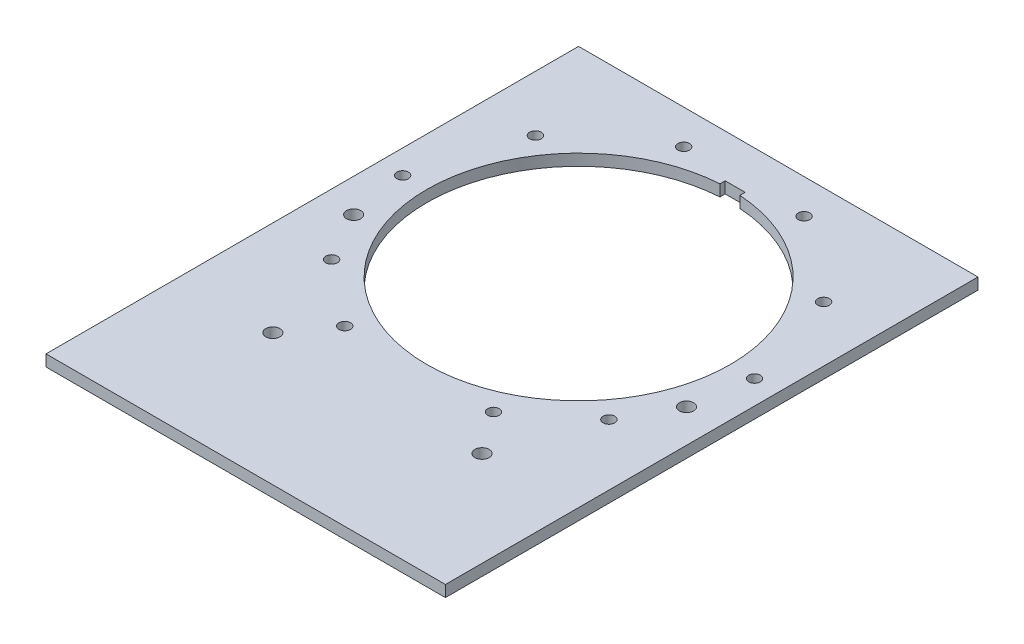
ISO-10303-21;
HEADER;
FILE_DESCRIPTION(('STEP AP214'),'2;1');
FILE_NAME('part.step','',(''),(''),'','','');
FILE_SCHEMA(('AUTOMOTIVE_DESIGN { 1 0 10303 214 1 1 1 1 }'));
ENDSEC;
DATA;
#1=APPLICATION_CONTEXT('core data for automotive mechanical design processes');
#2=APPLICATION_PROTOCOL_DEFINITION('international standard','automotive_design',2000,#1);
#3=PRODUCT_CONTEXT('',#1,'mechanical');
#4=PRODUCT('Part','Part','',(#3));
#5=PRODUCT_RELATED_PRODUCT_CATEGORY('part','',(#4));
#6=PRODUCT_DEFINITION_FORMATION('','',#4);
#7=PRODUCT_DEFINITION_CONTEXT('part definition',#1,'design');
#8=PRODUCT_DEFINITION('design','',#6,#7);
#9=PRODUCT_DEFINITION_SHAPE('','',#8);
#10=(LENGTH_UNIT() NAMED_UNIT(*) SI_UNIT(.MILLI.,.METRE.));
#11=(NAMED_UNIT(*) PLANE_ANGLE_UNIT() SI_UNIT($,.RADIAN.));
#12=(NAMED_UNIT(*) SI_UNIT($,.STERADIAN.) SOLID_ANGLE_UNIT());
#13=UNCERTAINTY_MEASURE_WITH_UNIT(LENGTH_MEASURE(1.E-05),#10,'distance_accuracy_value','');
#14=(GEOMETRIC_REPRESENTATION_CONTEXT(3) GLOBAL_UNCERTAINTY_ASSIGNED_CONTEXT((#13)) GLOBAL_UNIT_ASSIGNED_CONTEXT((#10,
#11,#12)) REPRESENTATION_CONTEXT('',''));
#15=CARTESIAN_POINT('',(0.,0.,0.));
#16=DIRECTION('',(0.,0.,1.));
#17=DIRECTION('',(1.,0.,0.));
#18=AXIS2_PLACEMENT_3D('',#15,#16,#17);
#19=CARTESIAN_POINT('',(0.,12.,0.));
#20=DIRECTION('',(0.,1.,0.));
#21=DIRECTION('',(0.,0.,1.));
#22=AXIS2_PLACEMENT_3D('',#19,#20,#21);
#23=PLANE('',#22);
#24=CARTESIAN_POINT('',(145.781989417244,12.,113.897372935246));
#25=DIRECTION('',(0.,1.,0.));
#26=DIRECTION('',(0.,0.,-1.));
#27=AXIS2_PLACEMENT_3D('',#24,#25,#26);
#28=CIRCLE('',#27,6.09999999999998);
#29=CARTESIAN_POINT('',(145.781989417244,12.,107.797372935246));
#30=VERTEX_POINT('',#29);
#31=EDGE_CURVE('E297',#30,#30,#28,.T.);
#32=ORIENTED_EDGE('',*,*,#31,.F.);
#33=EDGE_LOOP('',(#32));
#34=FACE_BOUND('',#33,.T.);
#35=CARTESIAN_POINT('',(-145.781989417244,12.,113.897372935246));
#36=DIRECTION('',(0.,1.,0.));
#37=DIRECTION('',(0.,0.,1.));
#38=AXIS2_PLACEMENT_3D('',#35,#36,#37);
#39=CIRCLE('',#38,6.09999999999998);
#40=CARTESIAN_POINT('',(-145.781989417244,12.,119.997372935246));
#41=VERTEX_POINT('',#40);
#42=EDGE_CURVE('E309',#41,#41,#39,.T.);
#43=ORIENTED_EDGE('',*,*,#42,.F.);
#44=EDGE_LOOP('',(#43));
#45=FACE_BOUND('',#44,.T.);
#46=CARTESIAN_POINT('',(-151.543128193463,12.,-106.111640724945));
#47=DIRECTION('',(0.,1.,0.));
#48=DIRECTION('',(0.,0.,1.));
#49=AXIS2_PLACEMENT_3D('',#46,#47,#48);
#50=CIRCLE('',#49,6.09999999999998);
#51=CARTESIAN_POINT('',(-151.543128193463,12.,-100.011640724945));
#52=VERTEX_POINT('',#51);
#53=EDGE_CURVE('E321',#52,#52,#50,.T.);
#54=ORIENTED_EDGE('',*,*,#53,.F.);
#55=EDGE_LOOP('',(#54));
#56=FACE_BOUND('',#55,.T.);
#57=CARTESIAN_POINT('',(175.,12.,61.5));
#58=DIRECTION('',(0.,1.,0.));
#59=DIRECTION('',(0.,0.,1.));
#60=AXIS2_PLACEMENT_3D('',#57,#58,#59);
#61=CIRCLE('',#60,7.50000000000001);
#62=CARTESIAN_POINT('',(175.,12.,69.));
#63=VERTEX_POINT('',#62);
#64=EDGE_CURVE('E333',#63,#63,#61,.T.);
#65=ORIENTED_EDGE('',*,*,#64,.F.);
#66=EDGE_LOOP('',(#65));
#67=FACE_BOUND('',#66,.T.);
#68=CARTESIAN_POINT('',(63.2737265152475,12.,-173.843134845393));
#69=DIRECTION('',(0.,1.,0.));
#70=DIRECTION('',(0.,0.,-1.));
#71=AXIS2_PLACEMENT_3D('',#68,#69,#70);
#72=CIRCLE('',#71,6.09999999999999);
#73=CARTESIAN_POINT('',(63.2737265152475,12.,-179.943134845393));
#74=VERTEX_POINT('',#73);
#75=EDGE_CURVE('E345',#74,#74,#72,.T.);
#76=ORIENTED_EDGE('',*,*,#75,.F.);
#77=EDGE_LOOP('',(#76));
#78=FACE_BOUND('',#77,.T.);
#79=CARTESIAN_POINT('',(-175.,12.,61.5));
#80=DIRECTION('',(0.,1.,0.));
#81=DIRECTION('',(0.,0.,1.));
#82=AXIS2_PLACEMENT_3D('',#79,#80,#81);
#83=CIRCLE('',#82,7.50000000000001);
#84=CARTESIAN_POINT('',(-175.,12.,69.));
#85=VERTEX_POINT('',#84);
#86=EDGE_CURVE('E357',#85,#85,#83,.T.);
#87=ORIENTED_EDGE('',*,*,#86,.F.);
#88=EDGE_LOOP('',(#87));
#89=FACE_BOUND('',#88,.T.);
#90=DIRECTION('',(0.,0.,1.));
#91=VECTOR('',#90,1.);
#92=CARTESIAN_POINT('',(-10.5,12.,-164.654013458662));
#93=LINE('',#92,#91);
#94=CARTESIAN_POINT('',(-10.5,12.,-164.654013458662));
#95=VERTEX_POINT('',#94);
#96=CARTESIAN_POINT('',(-10.4999999999999,12.,-159.154013458662));
#97=VERTEX_POINT('',#96);
#98=EDGE_CURVE('E107',#95,#97,#93,.T.);
#99=ORIENTED_EDGE('',*,*,#98,.F.);
#100=DIRECTION('',(-1.,0.,0.));
#101=VECTOR('',#100,1.);
#102=CARTESIAN_POINT('',(10.5,12.,-164.654013458662));
#103=LINE('',#102,#101);
#104=CARTESIAN_POINT('',(10.5,12.,-164.654013458662));
#105=VERTEX_POINT('',#104);
#106=EDGE_CURVE('E99',#105,#95,#103,.T.);
#107=ORIENTED_EDGE('',*,*,#106,.F.);
#108=DIRECTION('',(0.,0.,-1.));
#109=VECTOR('',#108,1.);
#110=CARTESIAN_POINT('',(10.5,12.,-164.654013458662));
#111=LINE('',#110,#109);
#112=CARTESIAN_POINT('',(10.5,12.,-159.154013458662));
#113=VERTEX_POINT('',#112);
#114=EDGE_CURVE('E122',#113,#105,#111,.T.);
#115=ORIENTED_EDGE('',*,*,#114,.F.);
#116=CARTESIAN_POINT('',(0.,12.,0.));
#117=DIRECTION('',(0.,1.,0.));
#118=DIRECTION('',(0.,0.,1.));
#119=AXIS2_PLACEMENT_3D('',#116,#117,#118);
#120=CIRCLE('',#119,159.5);
#121=EDGE_CURVE('E120',#97,#113,#120,.T.);
#122=ORIENTED_EDGE('',*,*,#121,.F.);
#123=EDGE_LOOP('',(#99,#107,#115,#122));
#124=FACE_BOUND('',#123,.T.);
#125=CARTESIAN_POINT('',(-63.2737265152472,12.,-173.843134845394));
#126=DIRECTION('',(0.,1.,0.));
#127=DIRECTION('',(0.,0.,1.));
#128=AXIS2_PLACEMENT_3D('',#125,#126,#127);
#129=CIRCLE('',#128,6.1);
#130=CARTESIAN_POINT('',(-63.2737265152472,12.,-167.743134845394));
#131=VERTEX_POINT('',#130);
#132=EDGE_CURVE('E138',#131,#131,#129,.T.);
#133=ORIENTED_EDGE('',*,*,#132,.F.);
#134=EDGE_LOOP('',(#133));
#135=FACE_BOUND('',#134,.T.);
#136=DIRECTION('',(0.,0.,1.));
#137=VECTOR('',#136,1.);
#138=CARTESIAN_POINT('',(-210.,12.,-210.));
#139=LINE('',#138,#137);
#140=CARTESIAN_POINT('',(-210.,12.,-210.));
#141=VERTEX_POINT('',#140);
#142=CARTESIAN_POINT('',(-210.,12.,350.));
#143=VERTEX_POINT('',#142);
#144=EDGE_CURVE('E144',#141,#143,#139,.T.);
#145=ORIENTED_EDGE('',*,*,#144,.T.);
#146=DIRECTION('',(1.,0.,0.));
#147=VECTOR('',#146,1.);
#148=CARTESIAN_POINT('',(-210.,12.,350.));
#149=LINE('',#148,#147);
#150=CARTESIAN_POINT('',(210.,12.,350.));
#151=VERTEX_POINT('',#150);
#152=EDGE_CURVE('E147',#143,#151,#149,.T.);
#153=ORIENTED_EDGE('',*,*,#152,.T.);
#154=DIRECTION('',(0.,0.,-1.));
#155=VECTOR('',#154,1.);
#156=CARTESIAN_POINT('',(210.,12.,-210.));
#157=LINE('',#156,#155);
#158=CARTESIAN_POINT('',(210.,12.,-210.));
#159=VERTEX_POINT('',#158);
#160=EDGE_CURVE('E150',#151,#159,#157,.T.);
#161=ORIENTED_EDGE('',*,*,#160,.T.);
#162=DIRECTION('',(-1.,0.,0.));
#163=VECTOR('',#162,1.);
#164=CARTESIAN_POINT('',(-210.,12.,-210.));
#165=LINE('',#164,#163);
#166=EDGE_CURVE('E152',#159,#141,#165,.T.);
#167=ORIENTED_EDGE('',*,*,#166,.T.);
#168=EDGE_LOOP('',(#145,#153,#161,#167));
#169=FACE_BOUND('',#168,.T.);
#170=CARTESIAN_POINT('',(151.543128193463,12.,-106.111640724944));
#171=DIRECTION('',(0.,1.,0.));
#172=DIRECTION('',(0.,0.,-1.));
#173=AXIS2_PLACEMENT_3D('',#170,#171,#172);
#174=CIRCLE('',#173,6.09999999999998);
#175=CARTESIAN_POINT('',(151.543128193463,12.,-112.211640724944));
#176=VERTEX_POINT('',#175);
#177=EDGE_CURVE('E128',#176,#176,#174,.T.);
#178=ORIENTED_EDGE('',*,*,#177,.F.);
#179=EDGE_LOOP('',(#178));
#180=FACE_BOUND('',#179,.T.);
#181=CARTESIAN_POINT('',(110.003214300474,12.,211.5));
#182=DIRECTION('',(0.,1.,0.));
#183=DIRECTION('',(0.,0.,1.));
#184=AXIS2_PLACEMENT_3D('',#181,#182,#183);
#185=CIRCLE('',#184,7.50000000000001);
#186=CARTESIAN_POINT('',(110.003214300474,12.,219.));
#187=VERTEX_POINT('',#186);
#188=EDGE_CURVE('E351',#187,#187,#185,.T.);
#189=ORIENTED_EDGE('',*,*,#188,.F.);
#190=EDGE_LOOP('',(#189));
#191=FACE_BOUND('',#190,.T.);
#192=CARTESIAN_POINT('',(-109.996785699526,12.,211.5));
#193=DIRECTION('',(0.,1.,0.));
#194=DIRECTION('',(0.,0.,1.));
#195=AXIS2_PLACEMENT_3D('',#192,#193,#194);
#196=CIRCLE('',#195,7.50000000000001);
#197=CARTESIAN_POINT('',(-109.996785699526,12.,219.));
#198=VERTEX_POINT('',#197);
#199=EDGE_CURVE('E339',#198,#198,#196,.T.);
#200=ORIENTED_EDGE('',*,*,#199,.F.);
#201=EDGE_LOOP('',(#200));
#202=FACE_BOUND('',#201,.T.);
#203=CARTESIAN_POINT('',(185.,12.,0.));
#204=DIRECTION('',(0.,1.,0.));
#205=DIRECTION('',(0.,0.,1.));
#206=AXIS2_PLACEMENT_3D('',#203,#204,#205);
#207=CIRCLE('',#206,6.09999999999998);
#208=CARTESIAN_POINT('',(185.,12.,6.09999999999998));
#209=VERTEX_POINT('',#208);
#210=EDGE_CURVE('E327',#209,#209,#207,.T.);
#211=ORIENTED_EDGE('',*,*,#210,.F.);
#212=EDGE_LOOP('',(#211));
#213=FACE_BOUND('',#212,.T.);
#214=CARTESIAN_POINT('',(-185.,12.,1.11022302462516E-13));
#215=DIRECTION('',(0.,1.,0.));
#216=DIRECTION('',(0.,0.,-1.));
#217=AXIS2_PLACEMENT_3D('',#214,#215,#216);
#218=CIRCLE('',#217,6.09999999999998);
#219=CARTESIAN_POINT('',(-185.,12.,-6.09999999999987));
#220=VERTEX_POINT('',#219);
#221=EDGE_CURVE('E315',#220,#220,#218,.T.);
#222=ORIENTED_EDGE('',*,*,#221,.F.);
#223=EDGE_LOOP('',(#222));
#224=FACE_BOUND('',#223,.T.);
#225=CARTESIAN_POINT('',(-78.1843784220302,12.,167.66694060178));
#226=DIRECTION('',(0.,1.,0.));
#227=DIRECTION('',(0.,0.,1.));
#228=AXIS2_PLACEMENT_3D('',#225,#226,#227);
#229=CIRCLE('',#228,6.09999999999999);
#230=CARTESIAN_POINT('',(-78.1843784220302,12.,173.76694060178));
#231=VERTEX_POINT('',#230);
#232=EDGE_CURVE('E303',#231,#231,#229,.T.);
#233=ORIENTED_EDGE('',*,*,#232,.F.);
#234=EDGE_LOOP('',(#233));
#235=FACE_BOUND('',#234,.T.);
#236=CARTESIAN_POINT('',(78.1843784220303,12.,167.66694060178));
#237=DIRECTION('',(0.,1.,0.));
#238=DIRECTION('',(0.,0.,-1.));
#239=AXIS2_PLACEMENT_3D('',#236,#237,#238);
#240=CIRCLE('',#239,6.09999999999999);
#241=CARTESIAN_POINT('',(78.1843784220303,12.,161.56694060178));
#242=VERTEX_POINT('',#241);
#243=EDGE_CURVE('E288',#242,#242,#240,.T.);
#244=ORIENTED_EDGE('',*,*,#243,.F.);
#245=EDGE_LOOP('',(#244));
#246=FACE_BOUND('',#245,.T.);
#247=ADVANCED_FACE('F34',(#34,#45,#56,#67,#78,#89,#124,#135,#169,#180,#191,#202,#213,#224,#235,
#246),#23,.T.);
#248=CARTESIAN_POINT('',(0.,0.,0.));
#249=DIRECTION('',(0.,1.,0.));
#250=DIRECTION('',(0.,0.,1.));
#251=AXIS2_PLACEMENT_3D('',#248,#249,#250);
#252=PLANE('',#251);
#253=CARTESIAN_POINT('',(-63.2737265152472,0.,-173.843134845394));
#254=DIRECTION('',(0.,1.,0.));
#255=DIRECTION('',(0.,0.,1.));
#256=AXIS2_PLACEMENT_3D('',#253,#254,#255);
#257=CIRCLE('',#256,6.1);
#258=CARTESIAN_POINT('',(-63.2737265152472,0.,-167.743134845394));
#259=VERTEX_POINT('',#258);
#260=EDGE_CURVE('E115',#259,#259,#257,.T.);
#261=ORIENTED_EDGE('',*,*,#260,.T.);
#262=EDGE_LOOP('',(#261));
#263=FACE_BOUND('',#262,.T.);
#264=DIRECTION('',(0.,0.,1.));
#265=VECTOR('',#264,1.);
#266=CARTESIAN_POINT('',(-210.,0.,-210.));
#267=LINE('',#266,#265);
#268=CARTESIAN_POINT('',(-210.,0.,-210.));
#269=VERTEX_POINT('',#268);
#270=CARTESIAN_POINT('',(-210.,0.,350.));
#271=VERTEX_POINT('',#270);
#272=EDGE_CURVE('E141',#269,#271,#267,.T.);
#273=ORIENTED_EDGE('',*,*,#272,.F.);
#274=DIRECTION('',(-1.,0.,0.));
#275=VECTOR('',#274,1.);
#276=CARTESIAN_POINT('',(-210.,0.,-210.));
#277=LINE('',#276,#275);
#278=CARTESIAN_POINT('',(210.,0.,-210.));
#279=VERTEX_POINT('',#278);
#280=EDGE_CURVE('E148',#279,#269,#277,.T.);
#281=ORIENTED_EDGE('',*,*,#280,.F.);
#282=DIRECTION('',(0.,0.,-1.));
#283=VECTOR('',#282,1.);
#284=CARTESIAN_POINT('',(210.,0.,-210.));
#285=LINE('',#284,#283);
#286=CARTESIAN_POINT('',(210.,0.,350.));
#287=VERTEX_POINT('',#286);
#288=EDGE_CURVE('E159',#287,#279,#285,.T.);
#289=ORIENTED_EDGE('',*,*,#288,.F.);
#290=DIRECTION('',(1.,0.,0.));
#291=VECTOR('',#290,1.);
#292=CARTESIAN_POINT('',(-210.,0.,350.));
#293=LINE('',#292,#291);
#294=EDGE_CURVE('E157',#271,#287,#293,.T.);
#295=ORIENTED_EDGE('',*,*,#294,.F.);
#296=EDGE_LOOP('',(#273,#281,#289,#295));
#297=FACE_BOUND('',#296,.T.);
#298=DIRECTION('',(-1.,0.,0.));
#299=VECTOR('',#298,1.);
#300=CARTESIAN_POINT('',(10.5,0.,-164.654013458662));
#301=LINE('',#300,#299);
#302=CARTESIAN_POINT('',(10.5,0.,-164.654013458662));
#303=VERTEX_POINT('',#302);
#304=CARTESIAN_POINT('',(-10.5,0.,-164.654013458662));
#305=VERTEX_POINT('',#304);
#306=EDGE_CURVE('E57',#303,#305,#301,.T.);
#307=ORIENTED_EDGE('',*,*,#306,.T.);
#308=DIRECTION('',(0.,0.,1.));
#309=VECTOR('',#308,1.);
#310=CARTESIAN_POINT('',(-10.5,0.,-164.654013458662));
#311=LINE('',#310,#309);
#312=CARTESIAN_POINT('',(-10.4999999999999,0.,-159.154013458662));
#313=VERTEX_POINT('',#312);
#314=EDGE_CURVE('E114',#305,#313,#311,.T.);
#315=ORIENTED_EDGE('',*,*,#314,.T.);
#316=CARTESIAN_POINT('',(0.,0.,0.));
#317=DIRECTION('',(0.,1.,0.));
#318=DIRECTION('',(0.,0.,1.));
#319=AXIS2_PLACEMENT_3D('',#316,#317,#318);
#320=CIRCLE('',#319,159.5);
#321=CARTESIAN_POINT('',(10.5,0.,-159.154013458662));
#322=VERTEX_POINT('',#321);
#323=EDGE_CURVE('E130',#313,#322,#320,.T.);
#324=ORIENTED_EDGE('',*,*,#323,.T.);
#325=DIRECTION('',(0.,0.,-1.));
#326=VECTOR('',#325,1.);
#327=CARTESIAN_POINT('',(10.5,0.,-164.654013458662));
#328=LINE('',#327,#326);
#329=EDGE_CURVE('E108',#322,#303,#328,.T.);
#330=ORIENTED_EDGE('',*,*,#329,.T.);
#331=EDGE_LOOP('',(#307,#315,#324,#330));
#332=FACE_BOUND('',#331,.T.);
#333=CARTESIAN_POINT('',(151.543128193463,0.,-106.111640724944));
#334=DIRECTION('',(0.,1.,0.));
#335=DIRECTION('',(0.,0.,-1.));
#336=AXIS2_PLACEMENT_3D('',#333,#334,#335);
#337=CIRCLE('',#336,6.09999999999998);
#338=CARTESIAN_POINT('',(151.543128193463,0.,-112.211640724944));
#339=VERTEX_POINT('',#338);
#340=EDGE_CURVE('E360',#339,#339,#337,.T.);
#341=ORIENTED_EDGE('',*,*,#340,.T.);
#342=EDGE_LOOP('',(#341));
#343=FACE_BOUND('',#342,.T.);
#344=CARTESIAN_POINT('',(-175.,0.,61.5));
#345=DIRECTION('',(0.,1.,0.));
#346=DIRECTION('',(0.,0.,1.));
#347=AXIS2_PLACEMENT_3D('',#344,#345,#346);
#348=CIRCLE('',#347,7.50000000000001);
#349=CARTESIAN_POINT('',(-175.,0.,69.));
#350=VERTEX_POINT('',#349);
#351=EDGE_CURVE('E354',#350,#350,#348,.T.);
#352=ORIENTED_EDGE('',*,*,#351,.T.);
#353=EDGE_LOOP('',(#352));
#354=FACE_BOUND('',#353,.T.);
#355=CARTESIAN_POINT('',(110.003214300474,0.,211.5));
#356=DIRECTION('',(0.,1.,0.));
#357=DIRECTION('',(0.,0.,1.));
#358=AXIS2_PLACEMENT_3D('',#355,#356,#357);
#359=CIRCLE('',#358,7.50000000000001);
#360=CARTESIAN_POINT('',(110.003214300474,0.,219.));
#361=VERTEX_POINT('',#360);
#362=EDGE_CURVE('E348',#361,#361,#359,.T.);
#363=ORIENTED_EDGE('',*,*,#362,.T.);
#364=EDGE_LOOP('',(#363));
#365=FACE_BOUND('',#364,.T.);
#366=CARTESIAN_POINT('',(63.2737265152475,0.,-173.843134845393));
#367=DIRECTION('',(0.,1.,0.));
#368=DIRECTION('',(0.,0.,-1.));
#369=AXIS2_PLACEMENT_3D('',#366,#367,#368);
#370=CIRCLE('',#369,6.09999999999999);
#371=CARTESIAN_POINT('',(63.2737265152475,0.,-179.943134845393));
#372=VERTEX_POINT('',#371);
#373=EDGE_CURVE('E342',#372,#372,#370,.T.);
#374=ORIENTED_EDGE('',*,*,#373,.T.);
#375=EDGE_LOOP('',(#374));
#376=FACE_BOUND('',#375,.T.);
#377=CARTESIAN_POINT('',(-109.996785699526,0.,211.5));
#378=DIRECTION('',(0.,1.,0.));
#379=DIRECTION('',(0.,0.,1.));
#380=AXIS2_PLACEMENT_3D('',#377,#378,#379);
#381=CIRCLE('',#380,7.50000000000001);
#382=CARTESIAN_POINT('',(-109.996785699526,0.,219.));
#383=VERTEX_POINT('',#382);
#384=EDGE_CURVE('E336',#383,#383,#381,.T.);
#385=ORIENTED_EDGE('',*,*,#384,.T.);
#386=EDGE_LOOP('',(#385));
#387=FACE_BOUND('',#386,.T.);
#388=CARTESIAN_POINT('',(175.,0.,61.5));
#389=DIRECTION('',(0.,1.,0.));
#390=DIRECTION('',(0.,0.,1.));
#391=AXIS2_PLACEMENT_3D('',#388,#389,#390);
#392=CIRCLE('',#391,7.50000000000001);
#393=CARTESIAN_POINT('',(175.,0.,69.));
#394=VERTEX_POINT('',#393);
#395=EDGE_CURVE('E330',#394,#394,#392,.T.);
#396=ORIENTED_EDGE('',*,*,#395,.T.);
#397=EDGE_LOOP('',(#396));
#398=FACE_BOUND('',#397,.T.);
#399=CARTESIAN_POINT('',(185.,0.,0.));
#400=DIRECTION('',(0.,1.,0.));
#401=DIRECTION('',(0.,0.,1.));
#402=AXIS2_PLACEMENT_3D('',#399,#400,#401);
#403=CIRCLE('',#402,6.09999999999998);
#404=CARTESIAN_POINT('',(185.,0.,6.09999999999998));
#405=VERTEX_POINT('',#404);
#406=EDGE_CURVE('E324',#405,#405,#403,.T.);
#407=ORIENTED_EDGE('',*,*,#406,.T.);
#408=EDGE_LOOP('',(#407));
#409=FACE_BOUND('',#408,.T.);
#410=CARTESIAN_POINT('',(-151.543128193463,0.,-106.111640724945));
#411=DIRECTION('',(0.,1.,0.));
#412=DIRECTION('',(0.,0.,1.));
#413=AXIS2_PLACEMENT_3D('',#410,#411,#412);
#414=CIRCLE('',#413,6.09999999999998);
#415=CARTESIAN_POINT('',(-151.543128193463,0.,-100.011640724945));
#416=VERTEX_POINT('',#415);
#417=EDGE_CURVE('E318',#416,#416,#414,.T.);
#418=ORIENTED_EDGE('',*,*,#417,.T.);
#419=EDGE_LOOP('',(#418));
#420=FACE_BOUND('',#419,.T.);
#421=CARTESIAN_POINT('',(-185.,0.,1.11022302462516E-13));
#422=DIRECTION('',(0.,1.,0.));
#423=DIRECTION('',(0.,0.,-1.));
#424=AXIS2_PLACEMENT_3D('',#421,#422,#423);
#425=CIRCLE('',#424,6.09999999999998);
#426=CARTESIAN_POINT('',(-185.,0.,-6.09999999999987));
#427=VERTEX_POINT('',#426);
#428=EDGE_CURVE('E312',#427,#427,#425,.T.);
#429=ORIENTED_EDGE('',*,*,#428,.T.);
#430=EDGE_LOOP('',(#429));
#431=FACE_BOUND('',#430,.T.);
#432=CARTESIAN_POINT('',(-145.781989417244,0.,113.897372935246));
#433=DIRECTION('',(0.,1.,0.));
#434=DIRECTION('',(0.,0.,1.));
#435=AXIS2_PLACEMENT_3D('',#432,#433,#434);
#436=CIRCLE('',#435,6.09999999999998);
#437=CARTESIAN_POINT('',(-145.781989417244,0.,119.997372935246));
#438=VERTEX_POINT('',#437);
#439=EDGE_CURVE('E306',#438,#438,#436,.T.);
#440=ORIENTED_EDGE('',*,*,#439,.T.);
#441=EDGE_LOOP('',(#440));
#442=FACE_BOUND('',#441,.T.);
#443=CARTESIAN_POINT('',(-78.1843784220302,0.,167.66694060178));
#444=DIRECTION('',(0.,1.,0.));
#445=DIRECTION('',(0.,0.,1.));
#446=AXIS2_PLACEMENT_3D('',#443,#444,#445);
#447=CIRCLE('',#446,6.09999999999999);
#448=CARTESIAN_POINT('',(-78.1843784220302,0.,173.76694060178));
#449=VERTEX_POINT('',#448);
#450=EDGE_CURVE('E300',#449,#449,#447,.T.);
#451=ORIENTED_EDGE('',*,*,#450,.T.);
#452=EDGE_LOOP('',(#451));
#453=FACE_BOUND('',#452,.T.);
#454=CARTESIAN_POINT('',(145.781989417244,0.,113.897372935246));
#455=DIRECTION('',(0.,1.,0.));
#456=DIRECTION('',(0.,0.,-1.));
#457=AXIS2_PLACEMENT_3D('',#454,#455,#456);
#458=CIRCLE('',#457,6.09999999999998);
#459=CARTESIAN_POINT('',(145.781989417244,0.,107.797372935246));
#460=VERTEX_POINT('',#459);
#461=EDGE_CURVE('E294',#460,#460,#458,.T.);
#462=ORIENTED_EDGE('',*,*,#461,.T.);
#463=EDGE_LOOP('',(#462));
#464=FACE_BOUND('',#463,.T.);
#465=CARTESIAN_POINT('',(78.1843784220303,0.,167.66694060178));
#466=DIRECTION('',(0.,1.,0.));
#467=DIRECTION('',(0.,0.,-1.));
#468=AXIS2_PLACEMENT_3D('',#465,#466,#467);
#469=CIRCLE('',#468,6.09999999999999);
#470=CARTESIAN_POINT('',(78.1843784220303,0.,161.56694060178));
#471=VERTEX_POINT('',#470);
#472=EDGE_CURVE('E291',#471,#471,#469,.T.);
#473=ORIENTED_EDGE('',*,*,#472,.T.);
#474=EDGE_LOOP('',(#473));
#475=FACE_BOUND('',#474,.T.);
#476=ADVANCED_FACE('F177',(#263,#297,#332,#343,#354,#365,#376,#387,#398,#409,#420,#431,#442,
#453,#464,#475),#252,.F.);
#477=CARTESIAN_POINT('',(-210.,12.,-210.));
#478=DIRECTION('',(1.,0.,0.));
#479=DIRECTION('',(0.,0.,-1.));
#480=AXIS2_PLACEMENT_3D('',#477,#478,#479);
#481=PLANE('',#480);
#482=ORIENTED_EDGE('',*,*,#272,.T.);
#483=DIRECTION('',(0.,-1.,0.));
#484=VECTOR('',#483,1.);
#485=CARTESIAN_POINT('',(-210.,12.,350.));
#486=LINE('',#485,#484);
#487=EDGE_CURVE('E11',#143,#271,#486,.T.);
#488=ORIENTED_EDGE('',*,*,#487,.F.);
#489=ORIENTED_EDGE('',*,*,#144,.F.);
#490=DIRECTION('',(0.,-1.,0.));
#491=VECTOR('',#490,1.);
#492=CARTESIAN_POINT('',(-210.,12.,-210.));
#493=LINE('',#492,#491);
#494=EDGE_CURVE('E154',#141,#269,#493,.T.);
#495=ORIENTED_EDGE('',*,*,#494,.T.);
#496=EDGE_LOOP('',(#482,#488,#489,#495));
#497=FACE_BOUND('',#496,.T.);
#498=ADVANCED_FACE('F36',(#497),#481,.F.);
#499=CARTESIAN_POINT('',(-210.,12.,350.));
#500=DIRECTION('',(0.,0.,-1.));
#501=DIRECTION('',(-1.,0.,0.));
#502=AXIS2_PLACEMENT_3D('',#499,#500,#501);
#503=PLANE('',#502);
#504=ORIENTED_EDGE('',*,*,#294,.T.);
#505=DIRECTION('',(0.,-1.,0.));
#506=VECTOR('',#505,1.);
#507=CARTESIAN_POINT('',(210.,12.,350.));
#508=LINE('',#507,#506);
#509=EDGE_CURVE('E42',#151,#287,#508,.T.);
#510=ORIENTED_EDGE('',*,*,#509,.F.);
#511=ORIENTED_EDGE('',*,*,#152,.F.);
#512=ORIENTED_EDGE('',*,*,#487,.T.);
#513=EDGE_LOOP('',(#504,#510,#511,#512));
#514=FACE_BOUND('',#513,.T.);
#515=ADVANCED_FACE('F188',(#514),#503,.F.);
#516=CARTESIAN_POINT('',(210.,12.,-210.));
#517=DIRECTION('',(-1.,0.,0.));
#518=DIRECTION('',(0.,0.,1.));
#519=AXIS2_PLACEMENT_3D('',#516,#517,#518);
#520=PLANE('',#519);
#521=ORIENTED_EDGE('',*,*,#288,.T.);
#522=DIRECTION('',(0.,-1.,0.));
#523=VECTOR('',#522,1.);
#524=CARTESIAN_POINT('',(210.,12.,-210.));
#525=LINE('',#524,#523);
#526=EDGE_CURVE('E164',#159,#279,#525,.T.);
#527=ORIENTED_EDGE('',*,*,#526,.F.);
#528=ORIENTED_EDGE('',*,*,#160,.F.);
#529=ORIENTED_EDGE('',*,*,#509,.T.);
#530=EDGE_LOOP('',(#521,#527,#528,#529));
#531=FACE_BOUND('',#530,.T.);
#532=ADVANCED_FACE('F171',(#531),#520,.F.);
#533=CARTESIAN_POINT('',(-210.,12.,-210.));
#534=DIRECTION('',(0.,0.,1.));
#535=DIRECTION('',(1.,0.,0.));
#536=AXIS2_PLACEMENT_3D('',#533,#534,#535);
#537=PLANE('',#536);
#538=ORIENTED_EDGE('',*,*,#280,.T.);
#539=ORIENTED_EDGE('',*,*,#494,.F.);
#540=ORIENTED_EDGE('',*,*,#166,.F.);
#541=ORIENTED_EDGE('',*,*,#526,.T.);
#542=EDGE_LOOP('',(#538,#539,#540,#541));
#543=FACE_BOUND('',#542,.T.);
#544=ADVANCED_FACE('F181',(#543),#537,.F.);
#545=CARTESIAN_POINT('',(-63.2737265152472,12.,-173.843134845394));
#546=DIRECTION('',(0.,-1.,0.));
#547=DIRECTION('',(0.,0.,-1.));
#548=AXIS2_PLACEMENT_3D('',#545,#546,#547);
#549=CYLINDRICAL_SURFACE('',#548,6.1);
#550=ORIENTED_EDGE('',*,*,#132,.T.);
#551=EDGE_LOOP('',(#550));
#552=FACE_BOUND('',#551,.T.);
#553=ORIENTED_EDGE('',*,*,#260,.F.);
#554=EDGE_LOOP('',(#553));
#555=FACE_BOUND('',#554,.T.);
#556=ADVANCED_FACE('F206',(#552,#555),#549,.F.);
#557=CARTESIAN_POINT('',(10.5,12.,-164.654013458662));
#558=DIRECTION('',(0.,0.,1.));
#559=DIRECTION('',(1.,0.,0.));
#560=AXIS2_PLACEMENT_3D('',#557,#558,#559);
#561=PLANE('',#560);
#562=ORIENTED_EDGE('',*,*,#306,.F.);
#563=DIRECTION('',(0.,-1.,0.));
#564=VECTOR('',#563,1.);
#565=CARTESIAN_POINT('',(10.5,12.,-164.654013458662));
#566=LINE('',#565,#564);
#567=EDGE_CURVE('E103',#105,#303,#566,.T.);
#568=ORIENTED_EDGE('',*,*,#567,.F.);
#569=ORIENTED_EDGE('',*,*,#106,.T.);
#570=DIRECTION('',(0.,-1.,0.));
#571=VECTOR('',#570,1.);
#572=CARTESIAN_POINT('',(-10.5,12.,-164.654013458662));
#573=LINE('',#572,#571);
#574=EDGE_CURVE('E102',#95,#305,#573,.T.);
#575=ORIENTED_EDGE('',*,*,#574,.T.);
#576=EDGE_LOOP('',(#562,#568,#569,#575));
#577=FACE_BOUND('',#576,.T.);
#578=ADVANCED_FACE('F101',(#577),#561,.T.);
#579=CARTESIAN_POINT('',(-10.5,12.,-164.654013458662));
#580=DIRECTION('',(1.,0.,0.));
#581=DIRECTION('',(0.,0.,-1.));
#582=AXIS2_PLACEMENT_3D('',#579,#580,#581);
#583=PLANE('',#582);
#584=ORIENTED_EDGE('',*,*,#314,.F.);
#585=ORIENTED_EDGE('',*,*,#574,.F.);
#586=ORIENTED_EDGE('',*,*,#98,.T.);
#587=DIRECTION('',(0.,-1.,0.));
#588=VECTOR('',#587,1.);
#589=CARTESIAN_POINT('',(-10.4999999999999,12.,-159.154013458662));
#590=LINE('',#589,#588);
#591=EDGE_CURVE('E116',#97,#313,#590,.T.);
#592=ORIENTED_EDGE('',*,*,#591,.T.);
#593=EDGE_LOOP('',(#584,#585,#586,#592));
#594=FACE_BOUND('',#593,.T.);
#595=ADVANCED_FACE('F111',(#594),#583,.T.);
#596=CARTESIAN_POINT('',(0.,12.,0.));
#597=DIRECTION('',(0.,-1.,0.));
#598=DIRECTION('',(0.,0.,-1.));
#599=AXIS2_PLACEMENT_3D('',#596,#597,#598);
#600=CYLINDRICAL_SURFACE('',#599,159.5);
#601=ORIENTED_EDGE('',*,*,#323,.F.);
#602=ORIENTED_EDGE('',*,*,#591,.F.);
#603=ORIENTED_EDGE('',*,*,#121,.T.);
#604=DIRECTION('',(0.,-1.,0.));
#605=VECTOR('',#604,1.);
#606=CARTESIAN_POINT('',(10.5,12.,-159.154013458662));
#607=LINE('',#606,#605);
#608=EDGE_CURVE('E49',#113,#322,#607,.T.);
#609=ORIENTED_EDGE('',*,*,#608,.T.);
#610=EDGE_LOOP('',(#601,#602,#603,#609));
#611=FACE_BOUND('',#610,.T.);
#612=ADVANCED_FACE('F223',(#611),#600,.F.);
#613=CARTESIAN_POINT('',(10.5,12.,-164.654013458662));
#614=DIRECTION('',(-1.,0.,0.));
#615=DIRECTION('',(0.,0.,1.));
#616=AXIS2_PLACEMENT_3D('',#613,#614,#615);
#617=PLANE('',#616);
#618=ORIENTED_EDGE('',*,*,#329,.F.);
#619=ORIENTED_EDGE('',*,*,#608,.F.);
#620=ORIENTED_EDGE('',*,*,#114,.T.);
#621=ORIENTED_EDGE('',*,*,#567,.T.);
#622=EDGE_LOOP('',(#618,#619,#620,#621));
#623=FACE_BOUND('',#622,.T.);
#624=ADVANCED_FACE('F228',(#623),#617,.T.);
#625=CARTESIAN_POINT('',(151.543128193463,12.,-106.111640724944));
#626=DIRECTION('',(0.,-1.,0.));
#627=DIRECTION('',(0.,0.,-1.));
#628=AXIS2_PLACEMENT_3D('',#625,#626,#627);
#629=CYLINDRICAL_SURFACE('',#628,6.09999999999998);
#630=ORIENTED_EDGE('',*,*,#177,.T.);
#631=EDGE_LOOP('',(#630));
#632=FACE_BOUND('',#631,.T.);
#633=ORIENTED_EDGE('',*,*,#340,.F.);
#634=EDGE_LOOP('',(#633));
#635=FACE_BOUND('',#634,.T.);
#636=ADVANCED_FACE('F232',(#632,#635),#629,.F.);
#637=CARTESIAN_POINT('',(-175.,12.,61.5));
#638=DIRECTION('',(0.,-1.,0.));
#639=DIRECTION('',(0.,0.,-1.));
#640=AXIS2_PLACEMENT_3D('',#637,#638,#639);
#641=CYLINDRICAL_SURFACE('',#640,7.50000000000001);
#642=ORIENTED_EDGE('',*,*,#86,.T.);
#643=EDGE_LOOP('',(#642));
#644=FACE_BOUND('',#643,.T.);
#645=ORIENTED_EDGE('',*,*,#351,.F.);
#646=EDGE_LOOP('',(#645));
#647=FACE_BOUND('',#646,.T.);
#648=ADVANCED_FACE('F235',(#644,#647),#641,.F.);
#649=CARTESIAN_POINT('',(110.003214300474,12.,211.5));
#650=DIRECTION('',(0.,-1.,0.));
#651=DIRECTION('',(0.,0.,-1.));
#652=AXIS2_PLACEMENT_3D('',#649,#650,#651);
#653=CYLINDRICAL_SURFACE('',#652,7.50000000000001);
#654=ORIENTED_EDGE('',*,*,#188,.T.);
#655=EDGE_LOOP('',(#654));
#656=FACE_BOUND('',#655,.T.);
#657=ORIENTED_EDGE('',*,*,#362,.F.);
#658=EDGE_LOOP('',(#657));
#659=FACE_BOUND('',#658,.T.);
#660=ADVANCED_FACE('F239',(#656,#659),#653,.F.);
#661=CARTESIAN_POINT('',(63.2737265152475,12.,-173.843134845393));
#662=DIRECTION('',(0.,-1.,0.));
#663=DIRECTION('',(0.,0.,-1.));
#664=AXIS2_PLACEMENT_3D('',#661,#662,#663);
#665=CYLINDRICAL_SURFACE('',#664,6.09999999999999);
#666=ORIENTED_EDGE('',*,*,#75,.T.);
#667=EDGE_LOOP('',(#666));
#668=FACE_BOUND('',#667,.T.);
#669=ORIENTED_EDGE('',*,*,#373,.F.);
#670=EDGE_LOOP('',(#669));
#671=FACE_BOUND('',#670,.T.);
#672=ADVANCED_FACE('F243',(#668,#671),#665,.F.);
#673=CARTESIAN_POINT('',(-109.996785699526,12.,211.5));
#674=DIRECTION('',(0.,-1.,0.));
#675=DIRECTION('',(0.,0.,-1.));
#676=AXIS2_PLACEMENT_3D('',#673,#674,#675);
#677=CYLINDRICAL_SURFACE('',#676,7.50000000000001);
#678=ORIENTED_EDGE('',*,*,#199,.T.);
#679=EDGE_LOOP('',(#678));
#680=FACE_BOUND('',#679,.T.);
#681=ORIENTED_EDGE('',*,*,#384,.F.);
#682=EDGE_LOOP('',(#681));
#683=FACE_BOUND('',#682,.T.);
#684=ADVANCED_FACE('F247',(#680,#683),#677,.F.);
#685=CARTESIAN_POINT('',(175.,12.,61.5));
#686=DIRECTION('',(0.,-1.,0.));
#687=DIRECTION('',(0.,0.,-1.));
#688=AXIS2_PLACEMENT_3D('',#685,#686,#687);
#689=CYLINDRICAL_SURFACE('',#688,7.50000000000001);
#690=ORIENTED_EDGE('',*,*,#64,.T.);
#691=EDGE_LOOP('',(#690));
#692=FACE_BOUND('',#691,.T.);
#693=ORIENTED_EDGE('',*,*,#395,.F.);
#694=EDGE_LOOP('',(#693));
#695=FACE_BOUND('',#694,.T.);
#696=ADVANCED_FACE('F251',(#692,#695),#689,.F.);
#697=CARTESIAN_POINT('',(185.,12.,0.));
#698=DIRECTION('',(0.,-1.,0.));
#699=DIRECTION('',(0.,0.,-1.));
#700=AXIS2_PLACEMENT_3D('',#697,#698,#699);
#701=CYLINDRICAL_SURFACE('',#700,6.09999999999998);
#702=ORIENTED_EDGE('',*,*,#210,.T.);
#703=EDGE_LOOP('',(#702));
#704=FACE_BOUND('',#703,.T.);
#705=ORIENTED_EDGE('',*,*,#406,.F.);
#706=EDGE_LOOP('',(#705));
#707=FACE_BOUND('',#706,.T.);
#708=ADVANCED_FACE('F255',(#704,#707),#701,.F.);
#709=CARTESIAN_POINT('',(-151.543128193463,12.,-106.111640724945));
#710=DIRECTION('',(0.,-1.,0.));
#711=DIRECTION('',(0.,0.,-1.));
#712=AXIS2_PLACEMENT_3D('',#709,#710,#711);
#713=CYLINDRICAL_SURFACE('',#712,6.09999999999998);
#714=ORIENTED_EDGE('',*,*,#53,.T.);
#715=EDGE_LOOP('',(#714));
#716=FACE_BOUND('',#715,.T.);
#717=ORIENTED_EDGE('',*,*,#417,.F.);
#718=EDGE_LOOP('',(#717));
#719=FACE_BOUND('',#718,.T.);
#720=ADVANCED_FACE('F259',(#716,#719),#713,.F.);
#721=CARTESIAN_POINT('',(-185.,12.,1.11022302462516E-13));
#722=DIRECTION('',(0.,-1.,0.));
#723=DIRECTION('',(0.,0.,-1.));
#724=AXIS2_PLACEMENT_3D('',#721,#722,#723);
#725=CYLINDRICAL_SURFACE('',#724,6.09999999999998);
#726=ORIENTED_EDGE('',*,*,#221,.T.);
#727=EDGE_LOOP('',(#726));
#728=FACE_BOUND('',#727,.T.);
#729=ORIENTED_EDGE('',*,*,#428,.F.);
#730=EDGE_LOOP('',(#729));
#731=FACE_BOUND('',#730,.T.);
#732=ADVANCED_FACE('F263',(#728,#731),#725,.F.);
#733=CARTESIAN_POINT('',(-145.781989417244,12.,113.897372935246));
#734=DIRECTION('',(0.,-1.,0.));
#735=DIRECTION('',(0.,0.,-1.));
#736=AXIS2_PLACEMENT_3D('',#733,#734,#735);
#737=CYLINDRICAL_SURFACE('',#736,6.09999999999998);
#738=ORIENTED_EDGE('',*,*,#42,.T.);
#739=EDGE_LOOP('',(#738));
#740=FACE_BOUND('',#739,.T.);
#741=ORIENTED_EDGE('',*,*,#439,.F.);
#742=EDGE_LOOP('',(#741));
#743=FACE_BOUND('',#742,.T.);
#744=ADVANCED_FACE('F267',(#740,#743),#737,.F.);
#745=CARTESIAN_POINT('',(-78.1843784220302,12.,167.66694060178));
#746=DIRECTION('',(0.,-1.,0.));
#747=DIRECTION('',(0.,0.,-1.));
#748=AXIS2_PLACEMENT_3D('',#745,#746,#747);
#749=CYLINDRICAL_SURFACE('',#748,6.09999999999999);
#750=ORIENTED_EDGE('',*,*,#232,.T.);
#751=EDGE_LOOP('',(#750));
#752=FACE_BOUND('',#751,.T.);
#753=ORIENTED_EDGE('',*,*,#450,.F.);
#754=EDGE_LOOP('',(#753));
#755=FACE_BOUND('',#754,.T.);
#756=ADVANCED_FACE('F271',(#752,#755),#749,.F.);
#757=CARTESIAN_POINT('',(145.781989417244,12.,113.897372935246));
#758=DIRECTION('',(0.,-1.,0.));
#759=DIRECTION('',(0.,0.,-1.));
#760=AXIS2_PLACEMENT_3D('',#757,#758,#759);
#761=CYLINDRICAL_SURFACE('',#760,6.09999999999998);
#762=ORIENTED_EDGE('',*,*,#31,.T.);
#763=EDGE_LOOP('',(#762));
#764=FACE_BOUND('',#763,.T.);
#765=ORIENTED_EDGE('',*,*,#461,.F.);
#766=EDGE_LOOP('',(#765));
#767=FACE_BOUND('',#766,.T.);
#768=ADVANCED_FACE('F275',(#764,#767),#761,.F.);
#769=CARTESIAN_POINT('',(78.1843784220303,12.,167.66694060178));
#770=DIRECTION('',(0.,-1.,0.));
#771=DIRECTION('',(0.,0.,-1.));
#772=AXIS2_PLACEMENT_3D('',#769,#770,#771);
#773=CYLINDRICAL_SURFACE('',#772,6.09999999999999);
#774=ORIENTED_EDGE('',*,*,#243,.T.);
#775=EDGE_LOOP('',(#774));
#776=FACE_BOUND('',#775,.T.);
#777=ORIENTED_EDGE('',*,*,#472,.F.);
#778=EDGE_LOOP('',(#777));
#779=FACE_BOUND('',#778,.T.);
#780=ADVANCED_FACE('F279',(#776,#779),#773,.F.);
#781=CLOSED_SHELL('',(#247,#476,#498,#515,#532,#544,#556,#578,#595,#612,#624,#636,#648,#660,
#672,#684,#696,#708,#720,#732,#744,#756,#768,#780));
#782=MANIFOLD_SOLID_BREP('B2',#781);
#783=ADVANCED_BREP_SHAPE_REPRESENTATION('',(#18,#782),#14);
#784=SHAPE_DEFINITION_REPRESENTATION(#9,#783);
ENDSEC;
END-ISO-10303-21;
